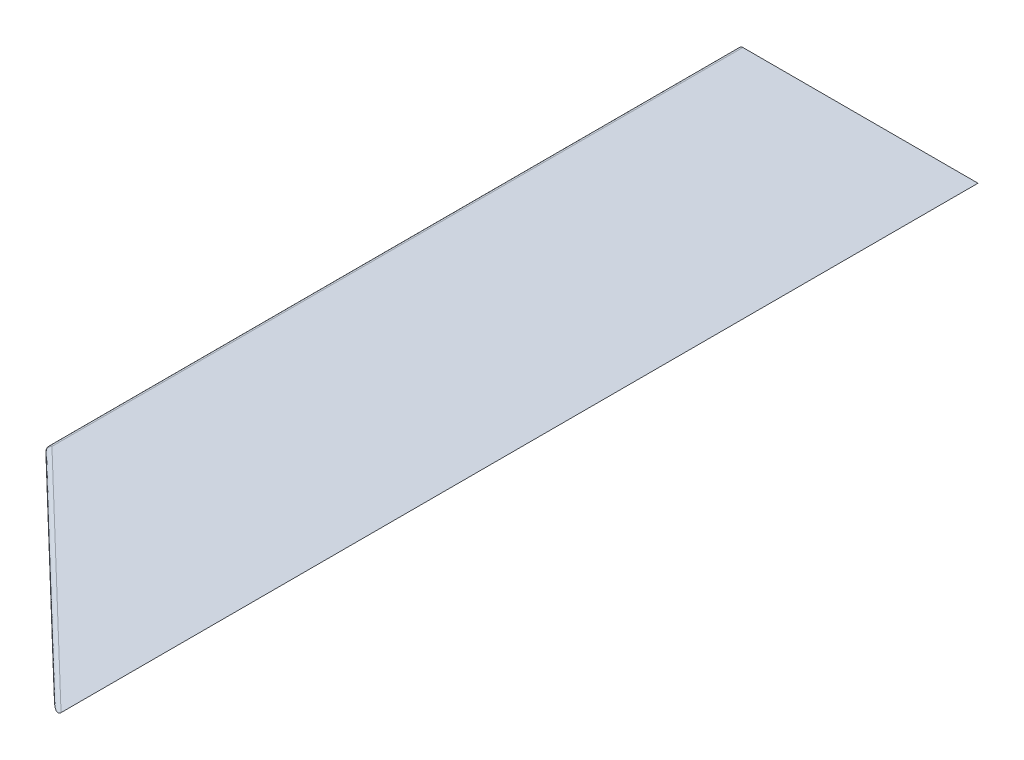
ISO-10303-21;
HEADER;
FILE_DESCRIPTION(('STEP AP214'),'2;1');
FILE_NAME('part.step','',(''),(''),'','','');
FILE_SCHEMA(('AUTOMOTIVE_DESIGN { 1 0 10303 214 1 1 1 1 }'));
ENDSEC;
DATA;
#1=APPLICATION_CONTEXT('core data for automotive mechanical design processes');
#2=APPLICATION_PROTOCOL_DEFINITION('international standard','automotive_design',2000,#1);
#3=PRODUCT_CONTEXT('',#1,'mechanical');
#4=PRODUCT('Part','Part','',(#3));
#5=PRODUCT_RELATED_PRODUCT_CATEGORY('part','',(#4));
#6=PRODUCT_DEFINITION_FORMATION('','',#4);
#7=PRODUCT_DEFINITION_CONTEXT('part definition',#1,'design');
#8=PRODUCT_DEFINITION('design','',#6,#7);
#9=PRODUCT_DEFINITION_SHAPE('','',#8);
#10=(LENGTH_UNIT() NAMED_UNIT(*) SI_UNIT(.MILLI.,.METRE.));
#11=(NAMED_UNIT(*) PLANE_ANGLE_UNIT() SI_UNIT($,.RADIAN.));
#12=(NAMED_UNIT(*) SI_UNIT($,.STERADIAN.) SOLID_ANGLE_UNIT());
#13=UNCERTAINTY_MEASURE_WITH_UNIT(LENGTH_MEASURE(1.E-05),#10,'distance_accuracy_value','');
#14=(GEOMETRIC_REPRESENTATION_CONTEXT(3) GLOBAL_UNCERTAINTY_ASSIGNED_CONTEXT((#13)) GLOBAL_UNIT_ASSIGNED_CONTEXT((#10,
#11,#12)) REPRESENTATION_CONTEXT('',''));
#15=CARTESIAN_POINT('',(0.,0.,0.));
#16=DIRECTION('',(0.,0.,1.));
#17=DIRECTION('',(1.,0.,0.));
#18=AXIS2_PLACEMENT_3D('',#15,#16,#17);
#19=CARTESIAN_POINT('',(3.175,-8.27786,522.522974032734));
#20=DIRECTION('',(0.,1.,0.));
#21=DIRECTION('',(0.,0.,1.));
#22=AXIS2_PLACEMENT_3D('',#19,#20,#21);
#23=CYLINDRICAL_SURFACE('',#22,3.175);
#24=DIRECTION('',(0.,1.,0.));
#25=VECTOR('',#24,1.);
#26=CARTESIAN_POINT('',(0.,6.35,522.522974032734));
#27=LINE('',#26,#25);
#28=CARTESIAN_POINT('',(0.,0.,522.522974032734));
#29=VERTEX_POINT('',#28);
#30=CARTESIAN_POINT('',(0.,3.175,522.522974032734));
#31=VERTEX_POINT('',#30);
#32=EDGE_CURVE('E76',#29,#31,#27,.T.);
#33=ORIENTED_EDGE('',*,*,#32,.F.);
#34=CARTESIAN_POINT('',(3.175,0.,522.522974032734));
#35=DIRECTION('',(0.,1.,0.));
#36=DIRECTION('',(0.,0.,1.));
#37=AXIS2_PLACEMENT_3D('',#34,#35,#36);
#38=CIRCLE('',#37,3.175);
#39=CARTESIAN_POINT('',(0.97472725905588,0.,524.811953033357));
#40=VERTEX_POINT('',#39);
#41=EDGE_CURVE('E19',#40,#29,#38,.F.);
#42=ORIENTED_EDGE('',*,*,#41,.F.);
#43=DIRECTION('',(0.,1.,0.));
#44=VECTOR('',#43,1.);
#45=CARTESIAN_POINT('',(0.974727259057256,6.35,524.811953033358));
#46=LINE('',#45,#44);
#47=CARTESIAN_POINT('',(0.974727257875206,3.175,524.811953032174));
#48=VERTEX_POINT('',#47);
#49=EDGE_CURVE('E93',#40,#48,#46,.T.);
#50=ORIENTED_EDGE('',*,*,#49,.T.);
#51=CARTESIAN_POINT('',(3.175,3.175,522.522974032734));
#52=DIRECTION('',(0.,1.,0.));
#53=DIRECTION('',(0.,0.,1.));
#54=AXIS2_PLACEMENT_3D('',#51,#52,#53);
#55=CIRCLE('',#54,3.175);
#56=EDGE_CURVE('E78',#31,#48,#55,.T.);
#57=ORIENTED_EDGE('',*,*,#56,.F.);
#58=EDGE_LOOP('',(#33,#42,#50,#57));
#59=FACE_BOUND('',#58,.T.);
#60=ADVANCED_FACE('F16',(#59),#23,.T.);
#61=CARTESIAN_POINT('',(0.,0.,0.));
#62=DIRECTION('',(0.,-1.,0.));
#63=DIRECTION('',(0.,0.,-1.));
#64=AXIS2_PLACEMENT_3D('',#61,#62,#63);
#65=PLANE('',#64);
#66=DIRECTION('',(-0.720938267918248,0.,-0.692999288492446));
#67=VECTOR('',#66,1.);
#68=CARTESIAN_POINT('',(180.975,0.,697.83656067156));
#69=LINE('',#68,#67);
#70=CARTESIAN_POINT('',(158.82991828161,0.,676.549681395778));
#71=VERTEX_POINT('',#70);
#72=EDGE_CURVE('E73',#71,#40,#69,.T.);
#73=ORIENTED_EDGE('',*,*,#72,.T.);
#74=ORIENTED_EDGE('',*,*,#41,.T.);
#75=DIRECTION('',(0.,0.,1.));
#76=VECTOR('',#75,1.);
#77=CARTESIAN_POINT('',(0.,0.,0.));
#78=LINE('',#77,#76);
#79=CARTESIAN_POINT('',(0.,0.,0.));
#80=VERTEX_POINT('',#79);
#81=EDGE_CURVE('E70',#80,#29,#78,.T.);
#82=ORIENTED_EDGE('',*,*,#81,.F.);
#83=DIRECTION('',(1.,0.,0.));
#84=VECTOR('',#83,1.);
#85=CARTESIAN_POINT('',(0.,0.,0.));
#86=LINE('',#85,#84);
#87=CARTESIAN_POINT('',(158.829918281616,0.,0.));
#88=VERTEX_POINT('',#87);
#89=EDGE_CURVE('E141',#80,#88,#86,.T.);
#90=ORIENTED_EDGE('',*,*,#89,.T.);
#91=DIRECTION('',(0.,0.,1.));
#92=VECTOR('',#91,1.);
#93=CARTESIAN_POINT('',(158.829918281616,0.,0.));
#94=LINE('',#93,#92);
#95=EDGE_CURVE('E142',#71,#88,#94,.F.);
#96=ORIENTED_EDGE('',*,*,#95,.F.);
#97=EDGE_LOOP('',(#73,#74,#82,#90,#96));
#98=FACE_BOUND('',#97,.T.);
#99=ADVANCED_FACE('F67',(#98),#65,.T.);
#100=CARTESIAN_POINT('',(0.,6.35,0.));
#101=DIRECTION('',(-1.,0.,0.));
#102=DIRECTION('',(0.,0.,1.));
#103=AXIS2_PLACEMENT_3D('',#100,#101,#102);
#104=PLANE('',#103);
#105=ORIENTED_EDGE('',*,*,#81,.T.);
#106=ORIENTED_EDGE('',*,*,#32,.T.);
#107=DIRECTION('',(0.,0.,-1.));
#108=VECTOR('',#107,1.);
#109=CARTESIAN_POINT('',(0.,3.175,1989.38896));
#110=LINE('',#109,#108);
#111=CARTESIAN_POINT('',(0.,3.175,0.));
#112=VERTEX_POINT('',#111);
#113=EDGE_CURVE('E108',#112,#31,#110,.F.);
#114=ORIENTED_EDGE('',*,*,#113,.F.);
#115=DIRECTION('',(0.,1.,0.));
#116=VECTOR('',#115,1.);
#117=CARTESIAN_POINT('',(0.,0.,0.));
#118=LINE('',#117,#116);
#119=EDGE_CURVE('E83',#112,#80,#118,.F.);
#120=ORIENTED_EDGE('',*,*,#119,.T.);
#121=EDGE_LOOP('',(#105,#106,#114,#120));
#122=FACE_BOUND('',#121,.T.);
#123=ADVANCED_FACE('F82',(#122),#104,.T.);
#124=CARTESIAN_POINT('',(3.175,3.175,522.522974032734));
#125=DIRECTION('',(-0.707106783321598,0.707106779051498,-1.60614752088899E-09));
#126=DIRECTION('',(-6.81167501274426E-10,-2.95260311945943E-09,-1.));
#127=AXIS2_PLACEMENT_3D('',#124,#125,#126);
#128=SPHERICAL_SURFACE('',#127,3.175);
#129=CARTESIAN_POINT('',(3.175,3.175,522.522974032734));
#130=DIRECTION('',(0.,0.,-1.));
#131=DIRECTION('',(-1.,0.,0.));
#132=AXIS2_PLACEMENT_3D('',#129,#130,#131);
#133=CIRCLE('',#132,3.175);
#134=CARTESIAN_POINT('',(0.929935962953957,5.42006402348853,522.522974032734));
#135=VERTEX_POINT('',#134);
#136=CARTESIAN_POINT('',(3.17499999768211,6.35,522.522974032763));
#137=VERTEX_POINT('',#136);
#138=EDGE_CURVE('E34',#135,#137,#133,.T.);
#139=ORIENTED_EDGE('',*,*,#138,.F.);
#140=CARTESIAN_POINT('',(3.175,3.175,522.522974032734));
#141=DIRECTION('',(0.,0.,-1.));
#142=DIRECTION('',(-1.,0.,0.));
#143=AXIS2_PLACEMENT_3D('',#140,#141,#142);
#144=CIRCLE('',#143,3.175);
#145=EDGE_CURVE('E105',#31,#135,#144,.T.);
#146=ORIENTED_EDGE('',*,*,#145,.F.);
#147=ORIENTED_EDGE('',*,*,#56,.T.);
#148=CARTESIAN_POINT('',(3.17499999765666,3.175,522.522974030349));
#149=DIRECTION('',(0.720938267918248,0.,0.692999288492446));
#150=DIRECTION('',(0.692999288492446,0.,-0.720938267918248));
#151=AXIS2_PLACEMENT_3D('',#148,#149,#150);
#152=CIRCLE('',#151,3.175);
#153=EDGE_CURVE('E101',#137,#48,#152,.T.);
#154=ORIENTED_EDGE('',*,*,#153,.F.);
#155=EDGE_LOOP('',(#139,#146,#147,#154));
#156=FACE_BOUND('',#155,.T.);
#157=ADVANCED_FACE('F111',(#156),#128,.T.);
#158=CARTESIAN_POINT('',(180.975,6.35,697.83656067156));
#159=DIRECTION('',(0.692999288492446,0.,-0.720938267918248));
#160=DIRECTION('',(-0.720938267918248,0.,-0.692999288492446));
#161=AXIS2_PLACEMENT_3D('',#158,#159,#160);
#162=PLANE('',#161);
#163=ORIENTED_EDGE('',*,*,#72,.F.);
#164=DIRECTION('',(-0.706010230216866,-0.202445175813205,-0.678649766535794));
#165=VECTOR('',#164,1.);
#166=CARTESIAN_POINT('',(169.902459140808,3.1749999999993,687.193121033666));
#167=LINE('',#166,#165);
#168=CARTESIAN_POINT('',(169.9024591408,3.17499999999401,687.193121033598));
#169=VERTEX_POINT('',#168);
#170=EDGE_CURVE('E118',#169,#71,#167,.T.);
#171=ORIENTED_EDGE('',*,*,#170,.F.);
#172=DIRECTION('',(0.720938267918248,0.,0.692999288492446));
#173=VECTOR('',#172,1.);
#174=CARTESIAN_POINT('',(-0.329839353453724,3.175,523.557943120774));
#175=LINE('',#174,#173);
#176=EDGE_CURVE('E100',#48,#169,#175,.T.);
#177=ORIENTED_EDGE('',*,*,#176,.F.);
#178=ORIENTED_EDGE('',*,*,#49,.F.);
#179=EDGE_LOOP('',(#163,#171,#177,#178));
#180=FACE_BOUND('',#179,.T.);
#181=ADVANCED_FACE('F116',(#180),#162,.F.);
#182=CARTESIAN_POINT('',(158.829918281616,0.,0.));
#183=DIRECTION('',(0.275637355817005,-0.961261695938317,0.));
#184=DIRECTION('',(0.961261695938317,0.275637355817005,0.));
#185=AXIS2_PLACEMENT_3D('',#182,#183,#184);
#186=PLANE('',#185);
#187=DIRECTION('',(0.,0.,1.));
#188=VECTOR('',#187,1.);
#189=CARTESIAN_POINT('',(180.975,6.35,0.));
#190=LINE('',#189,#188);
#191=CARTESIAN_POINT('',(180.975000000005,6.35,693.432577499516));
#192=VERTEX_POINT('',#191);
#193=CARTESIAN_POINT('',(180.975,6.35,0.));
#194=VERTEX_POINT('',#193);
#195=EDGE_CURVE('E99',#192,#194,#190,.F.);
#196=ORIENTED_EDGE('',*,*,#195,.F.);
#197=CARTESIAN_POINT('',(169.902459140811,3.175,682.789137861537));
#198=DIRECTION('',(0.275637355817005,-0.961261695938317,0.));
#199=DIRECTION('',(0.679720084477433,0.194906597831496,0.707101141902446));
#200=AXIS2_PLACEMENT_3D('',#197,#198,#199);
#201=ELLIPSE('',#200,15.9774539956602,3.175);
#202=EDGE_CURVE('E96',#169,#192,#201,.F.);
#203=ORIENTED_EDGE('',*,*,#202,.F.);
#204=ORIENTED_EDGE('',*,*,#170,.T.);
#205=ORIENTED_EDGE('',*,*,#95,.T.);
#206=DIRECTION('',(0.9612616959383,0.275637355817065,0.));
#207=VECTOR('',#206,1.);
#208=CARTESIAN_POINT('',(158.829918281616,0.,0.));
#209=LINE('',#208,#207);
#210=EDGE_CURVE('E109',#88,#194,#209,.T.);
#211=ORIENTED_EDGE('',*,*,#210,.T.);
#212=EDGE_LOOP('',(#196,#203,#204,#205,#211));
#213=FACE_BOUND('',#212,.T.);
#214=ADVANCED_FACE('F178',(#213),#186,.T.);
#215=CARTESIAN_POINT('',(0.,0.,0.));
#216=DIRECTION('',(0.,0.,1.));
#217=DIRECTION('',(1.,0.,0.));
#218=AXIS2_PLACEMENT_3D('',#215,#216,#217);
#219=PLANE('',#218);
#220=ORIENTED_EDGE('',*,*,#210,.F.);
#221=ORIENTED_EDGE('',*,*,#89,.F.);
#222=ORIENTED_EDGE('',*,*,#119,.F.);
#223=CARTESIAN_POINT('',(3.175,3.175,0.));
#224=DIRECTION('',(0.,0.,-1.));
#225=DIRECTION('',(-1.,0.,0.));
#226=AXIS2_PLACEMENT_3D('',#223,#224,#225);
#227=CIRCLE('',#226,3.175);
#228=CARTESIAN_POINT('',(3.17500000000001,6.35,0.));
#229=VERTEX_POINT('',#228);
#230=EDGE_CURVE('E106',#229,#112,#227,.F.);
#231=ORIENTED_EDGE('',*,*,#230,.F.);
#232=DIRECTION('',(1.,0.,0.));
#233=VECTOR('',#232,1.);
#234=CARTESIAN_POINT('',(180.975,6.35,0.));
#235=LINE('',#234,#233);
#236=EDGE_CURVE('E131',#194,#229,#235,.F.);
#237=ORIENTED_EDGE('',*,*,#236,.F.);
#238=EDGE_LOOP('',(#220,#221,#222,#231,#237));
#239=FACE_BOUND('',#238,.T.);
#240=ADVANCED_FACE('F176',(#239),#219,.F.);
#241=CARTESIAN_POINT('',(3.175,3.175,1989.38896));
#242=DIRECTION('',(0.,0.,-1.));
#243=DIRECTION('',(-1.,0.,0.));
#244=AXIS2_PLACEMENT_3D('',#241,#242,#243);
#245=CYLINDRICAL_SURFACE('',#244,3.175);
#246=ORIENTED_EDGE('',*,*,#113,.T.);
#247=ORIENTED_EDGE('',*,*,#145,.T.);
#248=ORIENTED_EDGE('',*,*,#138,.T.);
#249=DIRECTION('',(0.,0.,1.));
#250=VECTOR('',#249,1.);
#251=CARTESIAN_POINT('',(3.17500000000001,6.35,0.));
#252=LINE('',#251,#250);
#253=EDGE_CURVE('E25',#229,#137,#252,.T.);
#254=ORIENTED_EDGE('',*,*,#253,.F.);
#255=ORIENTED_EDGE('',*,*,#230,.T.);
#256=EDGE_LOOP('',(#246,#247,#248,#254,#255));
#257=FACE_BOUND('',#256,.T.);
#258=ADVANCED_FACE('F171',(#257),#245,.T.);
#259=CARTESIAN_POINT('',(1.87043338750979,3.175,521.268964120134));
#260=DIRECTION('',(0.720938267918248,0.,0.692999288492446));
#261=DIRECTION('',(0.692999288492446,0.,-0.720938267918248));
#262=AXIS2_PLACEMENT_3D('',#259,#260,#261);
#263=CYLINDRICAL_SURFACE('',#262,3.175);
#264=ORIENTED_EDGE('',*,*,#176,.T.);
#265=ORIENTED_EDGE('',*,*,#202,.T.);
#266=DIRECTION('',(0.720938267918233,0.,0.692999288492462));
#267=VECTOR('',#266,1.);
#268=CARTESIAN_POINT('',(3.1749999975616,6.35,522.522974030448));
#269=LINE('',#268,#267);
#270=EDGE_CURVE('E11',#137,#192,#269,.T.);
#271=ORIENTED_EDGE('',*,*,#270,.F.);
#272=ORIENTED_EDGE('',*,*,#153,.T.);
#273=EDGE_LOOP('',(#264,#265,#271,#272));
#274=FACE_BOUND('',#273,.T.);
#275=ADVANCED_FACE('F123',(#274),#263,.T.);
#276=CARTESIAN_POINT('',(180.975,6.35,0.));
#277=DIRECTION('',(0.,1.,0.));
#278=DIRECTION('',(0.,0.,1.));
#279=AXIS2_PLACEMENT_3D('',#276,#277,#278);
#280=PLANE('',#279);
#281=ORIENTED_EDGE('',*,*,#253,.T.);
#282=ORIENTED_EDGE('',*,*,#270,.T.);
#283=ORIENTED_EDGE('',*,*,#195,.T.);
#284=ORIENTED_EDGE('',*,*,#236,.T.);
#285=EDGE_LOOP('',(#281,#282,#283,#284));
#286=FACE_BOUND('',#285,.T.);
#287=ADVANCED_FACE('F129',(#286),#280,.T.);
#288=CLOSED_SHELL('',(#60,#99,#123,#157,#181,#214,#240,#258,#275,#287));
#289=MANIFOLD_SOLID_BREP('B1',#288);
#290=ADVANCED_BREP_SHAPE_REPRESENTATION('',(#18,#289),#14);
#291=SHAPE_DEFINITION_REPRESENTATION(#9,#290);
ENDSEC;
END-ISO-10303-21;
